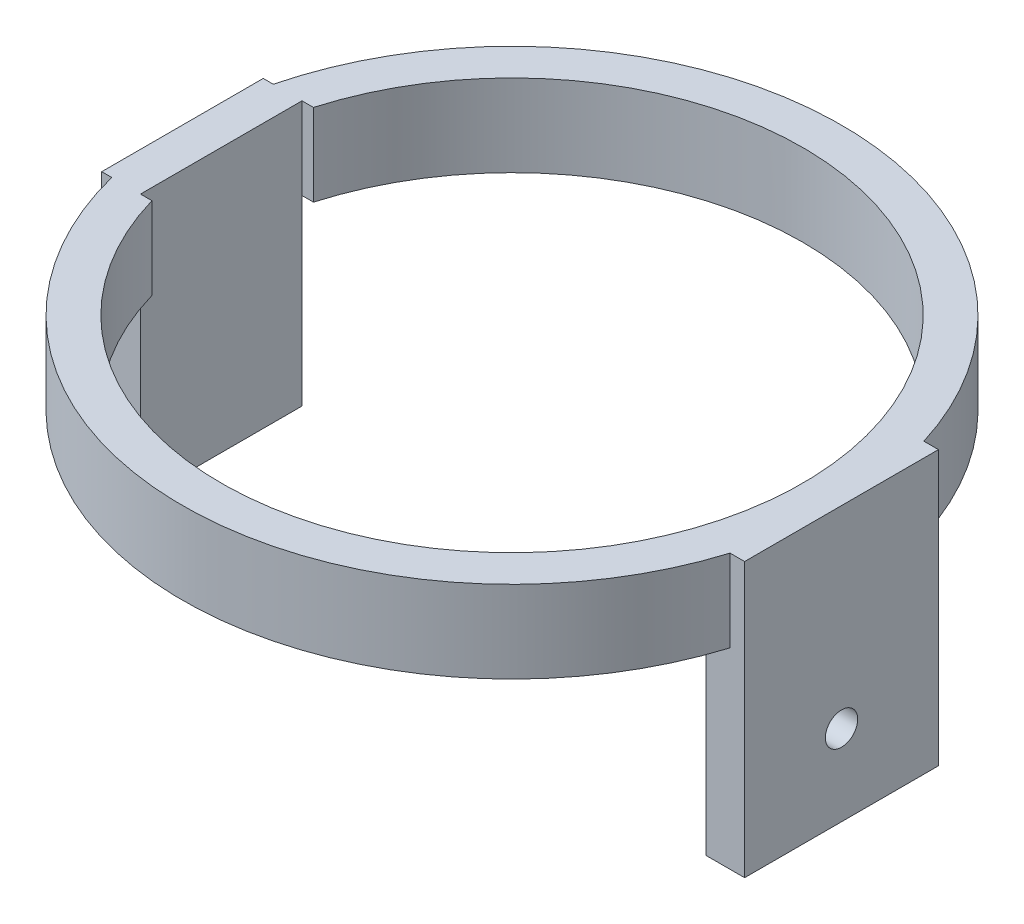
ISO-10303-21;
HEADER;
FILE_DESCRIPTION(('STEP AP214'),'2;1');
FILE_NAME('part.step','',(''),(''),'','','');
FILE_SCHEMA(('AUTOMOTIVE_DESIGN { 1 0 10303 214 1 1 1 1 }'));
ENDSEC;
DATA;
#1=APPLICATION_CONTEXT('core data for automotive mechanical design processes');
#2=APPLICATION_PROTOCOL_DEFINITION('international standard','automotive_design',2000,#1);
#3=PRODUCT_CONTEXT('',#1,'mechanical');
#4=PRODUCT('Part','Part','',(#3));
#5=PRODUCT_RELATED_PRODUCT_CATEGORY('part','',(#4));
#6=PRODUCT_DEFINITION_FORMATION('','',#4);
#7=PRODUCT_DEFINITION_CONTEXT('part definition',#1,'design');
#8=PRODUCT_DEFINITION('design','',#6,#7);
#9=PRODUCT_DEFINITION_SHAPE('','',#8);
#10=(LENGTH_UNIT() NAMED_UNIT(*) SI_UNIT(.MILLI.,.METRE.));
#11=(NAMED_UNIT(*) PLANE_ANGLE_UNIT() SI_UNIT($,.RADIAN.));
#12=(NAMED_UNIT(*) SI_UNIT($,.STERADIAN.) SOLID_ANGLE_UNIT());
#13=UNCERTAINTY_MEASURE_WITH_UNIT(LENGTH_MEASURE(1.E-05),#10,'distance_accuracy_value','');
#14=(GEOMETRIC_REPRESENTATION_CONTEXT(3) GLOBAL_UNCERTAINTY_ASSIGNED_CONTEXT((#13)) GLOBAL_UNIT_ASSIGNED_CONTEXT((#10,
#11,#12)) REPRESENTATION_CONTEXT('',''));
#15=CARTESIAN_POINT('',(0.,0.,0.));
#16=DIRECTION('',(0.,0.,1.));
#17=DIRECTION('',(1.,0.,0.));
#18=AXIS2_PLACEMENT_3D('',#15,#16,#17);
#19=CARTESIAN_POINT('',(0.,-25.4,0.));
#20=DIRECTION('',(0.,1.,0.));
#21=DIRECTION('',(0.,0.,1.));
#22=AXIS2_PLACEMENT_3D('',#19,#20,#21);
#23=CYLINDRICAL_SURFACE('',#22,102.);
#24=CARTESIAN_POINT('',(0.,-25.4,0.));
#25=DIRECTION('',(0.,1.,0.));
#26=DIRECTION('',(0.,0.,1.));
#27=AXIS2_PLACEMENT_3D('',#24,#25,#26);
#28=CIRCLE('',#27,102.);
#29=CARTESIAN_POINT('',(-98.8888264668966,-25.4,25.));
#30=VERTEX_POINT('',#29);
#31=CARTESIAN_POINT('',(97.4884608556315,-25.4,30.));
#32=VERTEX_POINT('',#31);
#33=EDGE_CURVE('E11',#30,#32,#28,.T.);
#34=ORIENTED_EDGE('',*,*,#33,.T.);
#35=DIRECTION('',(0.,1.,0.));
#36=VECTOR('',#35,1.);
#37=CARTESIAN_POINT('',(97.4884608556315,-25.4,30.));
#38=LINE('',#37,#36);
#39=CARTESIAN_POINT('',(97.4884608556315,0.,30.));
#40=VERTEX_POINT('',#39);
#41=EDGE_CURVE('E208',#32,#40,#38,.T.);
#42=ORIENTED_EDGE('',*,*,#41,.T.);
#43=CARTESIAN_POINT('',(0.,0.,0.));
#44=DIRECTION('',(0.,1.,0.));
#45=DIRECTION('',(0.,0.,1.));
#46=AXIS2_PLACEMENT_3D('',#43,#44,#45);
#47=CIRCLE('',#46,102.);
#48=CARTESIAN_POINT('',(-98.8888264668966,0.,25.));
#49=VERTEX_POINT('',#48);
#50=EDGE_CURVE('E43',#49,#40,#47,.T.);
#51=ORIENTED_EDGE('',*,*,#50,.F.);
#52=DIRECTION('',(0.,1.,0.));
#53=VECTOR('',#52,1.);
#54=CARTESIAN_POINT('',(-98.8888264668966,-25.4,25.));
#55=LINE('',#54,#53);
#56=EDGE_CURVE('E290',#30,#49,#55,.T.);
#57=ORIENTED_EDGE('',*,*,#56,.F.);
#58=EDGE_LOOP('',(#34,#42,#51,#57));
#59=FACE_BOUND('',#58,.T.);
#60=ADVANCED_FACE('F39',(#59),#23,.T.);
#61=CARTESIAN_POINT('',(0.,-25.4,0.));
#62=DIRECTION('',(0.,1.,0.));
#63=DIRECTION('',(0.,0.,1.));
#64=AXIS2_PLACEMENT_3D('',#61,#62,#63);
#65=PLANE('',#64);
#66=DIRECTION('',(0.,0.,-1.));
#67=VECTOR('',#66,1.);
#68=CARTESIAN_POINT('',(90.,-25.4,0.));
#69=LINE('',#68,#67);
#70=CARTESIAN_POINT('',(90.,-25.4,30.));
#71=VERTEX_POINT('',#70);
#72=CARTESIAN_POINT('',(90.,-25.4,0.));
#73=VERTEX_POINT('',#72);
#74=EDGE_CURVE('E203',#71,#73,#69,.T.);
#75=ORIENTED_EDGE('',*,*,#74,.F.);
#76=DIRECTION('',(-1.,0.,0.));
#77=VECTOR('',#76,1.);
#78=CARTESIAN_POINT('',(0.,-25.4,30.));
#79=LINE('',#78,#77);
#80=EDGE_CURVE('E204',#32,#71,#79,.T.);
#81=ORIENTED_EDGE('',*,*,#80,.F.);
#82=ORIENTED_EDGE('',*,*,#33,.F.);
#83=DIRECTION('',(1.,0.,0.));
#84=VECTOR('',#83,1.);
#85=CARTESIAN_POINT('',(0.,-25.4,25.));
#86=LINE('',#85,#84);
#87=CARTESIAN_POINT('',(-90.,-25.4,25.));
#88=VERTEX_POINT('',#87);
#89=EDGE_CURVE('E272',#30,#88,#86,.T.);
#90=ORIENTED_EDGE('',*,*,#89,.T.);
#91=DIRECTION('',(-1.,0.,0.));
#92=VECTOR('',#91,1.);
#93=CARTESIAN_POINT('',(-90.,-25.4,25.));
#94=LINE('',#93,#92);
#95=CARTESIAN_POINT('',(-86.4580823289529,-25.4,25.));
#96=VERTEX_POINT('',#95);
#97=EDGE_CURVE('E216',#96,#88,#94,.T.);
#98=ORIENTED_EDGE('',*,*,#97,.F.);
#99=CARTESIAN_POINT('',(0.,-25.4,0.));
#100=DIRECTION('',(0.,1.,0.));
#101=DIRECTION('',(0.,0.,1.));
#102=AXIS2_PLACEMENT_3D('',#99,#100,#101);
#103=CIRCLE('',#102,90.);
#104=EDGE_CURVE('E303',#96,#73,#103,.T.);
#105=ORIENTED_EDGE('',*,*,#104,.T.);
#106=EDGE_LOOP('',(#75,#81,#82,#90,#98,#105));
#107=FACE_BOUND('',#106,.T.);
#108=ADVANCED_FACE('F340',(#107),#65,.F.);
#109=DIRECTION('',(0.,1.,0.));
#110=VECTOR('',#109,1.);
#111=CARTESIAN_POINT('',(97.4884608556315,-25.4,-30.));
#112=LINE('',#111,#110);
#113=CARTESIAN_POINT('',(97.4884608556315,-25.4,-30.));
#114=VERTEX_POINT('',#113);
#115=CARTESIAN_POINT('',(97.4884608556315,0.,-30.));
#116=VERTEX_POINT('',#115);
#117=EDGE_CURVE('E64',#114,#116,#112,.T.);
#118=ORIENTED_EDGE('',*,*,#117,.F.);
#119=CARTESIAN_POINT('',(-98.8888264668966,-25.4,-25.));
#120=VERTEX_POINT('',#119);
#121=EDGE_CURVE('E49',#114,#120,#28,.T.);
#122=ORIENTED_EDGE('',*,*,#121,.T.);
#123=DIRECTION('',(0.,1.,0.));
#124=VECTOR('',#123,1.);
#125=CARTESIAN_POINT('',(-98.8888264668966,-25.4,-25.));
#126=LINE('',#125,#124);
#127=CARTESIAN_POINT('',(-98.8888264668966,0.,-25.));
#128=VERTEX_POINT('',#127);
#129=EDGE_CURVE('E298',#120,#128,#126,.T.);
#130=ORIENTED_EDGE('',*,*,#129,.T.);
#131=EDGE_CURVE('E307',#116,#128,#47,.T.);
#132=ORIENTED_EDGE('',*,*,#131,.F.);
#133=EDGE_LOOP('',(#118,#122,#130,#132));
#134=FACE_BOUND('',#133,.T.);
#135=ADVANCED_FACE('F41',(#134),#23,.T.);
#136=ORIENTED_EDGE('',*,*,#121,.F.);
#137=DIRECTION('',(-1.,0.,0.));
#138=VECTOR('',#137,1.);
#139=CARTESIAN_POINT('',(0.,-25.4,-30.));
#140=LINE('',#139,#138);
#141=CARTESIAN_POINT('',(90.,-25.4,-30.));
#142=VERTEX_POINT('',#141);
#143=EDGE_CURVE('E56',#114,#142,#140,.T.);
#144=ORIENTED_EDGE('',*,*,#143,.T.);
#145=EDGE_CURVE('E200',#73,#142,#69,.T.);
#146=ORIENTED_EDGE('',*,*,#145,.F.);
#147=CARTESIAN_POINT('',(-86.4580823289529,-25.4,-25.));
#148=VERTEX_POINT('',#147);
#149=EDGE_CURVE('E308',#73,#148,#103,.T.);
#150=ORIENTED_EDGE('',*,*,#149,.T.);
#151=DIRECTION('',(1.,0.,0.));
#152=VECTOR('',#151,1.);
#153=CARTESIAN_POINT('',(-86.4580823289529,-25.4,-25.));
#154=LINE('',#153,#152);
#155=CARTESIAN_POINT('',(-90.,-25.4,-25.));
#156=VERTEX_POINT('',#155);
#157=EDGE_CURVE('E215',#156,#148,#154,.T.);
#158=ORIENTED_EDGE('',*,*,#157,.F.);
#159=DIRECTION('',(1.,0.,0.));
#160=VECTOR('',#159,1.);
#161=CARTESIAN_POINT('',(0.,-25.4,-25.));
#162=LINE('',#161,#160);
#163=EDGE_CURVE('E294',#120,#156,#162,.T.);
#164=ORIENTED_EDGE('',*,*,#163,.F.);
#165=EDGE_LOOP('',(#136,#144,#146,#150,#158,#164));
#166=FACE_BOUND('',#165,.T.);
#167=ADVANCED_FACE('F317',(#166),#65,.F.);
#168=CARTESIAN_POINT('',(0.,0.,0.));
#169=DIRECTION('',(0.,1.,0.));
#170=DIRECTION('',(0.,0.,1.));
#171=AXIS2_PLACEMENT_3D('',#168,#169,#170);
#172=PLANE('',#171);
#173=DIRECTION('',(1.,0.,0.));
#174=VECTOR('',#173,1.);
#175=CARTESIAN_POINT('',(-86.4580823289529,0.,-25.));
#176=LINE('',#175,#174);
#177=CARTESIAN_POINT('',(-90.,0.,-25.));
#178=VERTEX_POINT('',#177);
#179=CARTESIAN_POINT('',(-86.4580823289529,0.,-25.));
#180=VERTEX_POINT('',#179);
#181=EDGE_CURVE('E220',#178,#180,#176,.T.);
#182=ORIENTED_EDGE('',*,*,#181,.T.);
#183=CARTESIAN_POINT('',(0.,0.,0.));
#184=DIRECTION('',(0.,1.,0.));
#185=DIRECTION('',(0.,0.,1.));
#186=AXIS2_PLACEMENT_3D('',#183,#184,#185);
#187=CIRCLE('',#186,90.);
#188=CARTESIAN_POINT('',(-86.4580823289529,0.,25.));
#189=VERTEX_POINT('',#188);
#190=EDGE_CURVE('E302',#189,#180,#187,.T.);
#191=ORIENTED_EDGE('',*,*,#190,.F.);
#192=DIRECTION('',(-1.,0.,0.));
#193=VECTOR('',#192,1.);
#194=CARTESIAN_POINT('',(-90.,0.,25.));
#195=LINE('',#194,#193);
#196=CARTESIAN_POINT('',(-90.,0.,25.));
#197=VERTEX_POINT('',#196);
#198=EDGE_CURVE('E233',#189,#197,#195,.T.);
#199=ORIENTED_EDGE('',*,*,#198,.T.);
#200=DIRECTION('',(0.,0.,-1.));
#201=VECTOR('',#200,1.);
#202=CARTESIAN_POINT('',(-90.,0.,25.));
#203=LINE('',#202,#201);
#204=EDGE_CURVE('E228',#197,#178,#203,.T.);
#205=ORIENTED_EDGE('',*,*,#204,.T.);
#206=EDGE_LOOP('',(#182,#191,#199,#205));
#207=FACE_BOUND('',#206,.T.);
#208=ORIENTED_EDGE('',*,*,#50,.T.);
#209=DIRECTION('',(-1.,0.,0.));
#210=VECTOR('',#209,1.);
#211=CARTESIAN_POINT('',(205.85585043824,0.,30.));
#212=LINE('',#211,#210);
#213=CARTESIAN_POINT('',(102.,0.,30.));
#214=VERTEX_POINT('',#213);
#215=EDGE_CURVE('E192',#214,#40,#212,.T.);
#216=ORIENTED_EDGE('',*,*,#215,.F.);
#217=DIRECTION('',(0.,0.,1.));
#218=VECTOR('',#217,1.);
#219=CARTESIAN_POINT('',(102.,0.,-30.));
#220=LINE('',#219,#218);
#221=CARTESIAN_POINT('',(102.,0.,-30.));
#222=VERTEX_POINT('',#221);
#223=EDGE_CURVE('E186',#222,#214,#220,.T.);
#224=ORIENTED_EDGE('',*,*,#223,.F.);
#225=DIRECTION('',(-1.,0.,0.));
#226=VECTOR('',#225,1.);
#227=CARTESIAN_POINT('',(205.85585043824,0.,-30.));
#228=LINE('',#227,#226);
#229=EDGE_CURVE('E177',#222,#116,#228,.T.);
#230=ORIENTED_EDGE('',*,*,#229,.T.);
#231=ORIENTED_EDGE('',*,*,#131,.T.);
#232=DIRECTION('',(1.,0.,0.));
#233=VECTOR('',#232,1.);
#234=CARTESIAN_POINT('',(-197.899625072051,0.,-25.));
#235=LINE('',#234,#233);
#236=CARTESIAN_POINT('',(-102.,0.,-25.));
#237=VERTEX_POINT('',#236);
#238=EDGE_CURVE('E247',#237,#128,#235,.T.);
#239=ORIENTED_EDGE('',*,*,#238,.F.);
#240=DIRECTION('',(0.,0.,-1.));
#241=VECTOR('',#240,1.);
#242=CARTESIAN_POINT('',(-102.,0.,25.));
#243=LINE('',#242,#241);
#244=CARTESIAN_POINT('',(-102.,0.,25.));
#245=VERTEX_POINT('',#244);
#246=EDGE_CURVE('E256',#245,#237,#243,.T.);
#247=ORIENTED_EDGE('',*,*,#246,.F.);
#248=DIRECTION('',(1.,0.,0.));
#249=VECTOR('',#248,1.);
#250=CARTESIAN_POINT('',(-197.899625072051,0.,25.));
#251=LINE('',#250,#249);
#252=EDGE_CURVE('E260',#245,#49,#251,.T.);
#253=ORIENTED_EDGE('',*,*,#252,.T.);
#254=EDGE_LOOP('',(#208,#216,#224,#230,#231,#239,#247,#253));
#255=FACE_BOUND('',#254,.T.);
#256=ADVANCED_FACE('F327',(#207,#255),#172,.T.);
#257=CARTESIAN_POINT('',(0.,-25.4,0.));
#258=DIRECTION('',(0.,1.,0.));
#259=DIRECTION('',(0.,0.,1.));
#260=AXIS2_PLACEMENT_3D('',#257,#258,#259);
#261=CYLINDRICAL_SURFACE('',#260,90.);
#262=ORIENTED_EDGE('',*,*,#190,.T.);
#263=DIRECTION('',(0.,-1.,0.));
#264=VECTOR('',#263,1.);
#265=CARTESIAN_POINT('',(-86.4580823289529,50.1252948199657,-25.));
#266=LINE('',#265,#264);
#267=EDGE_CURVE('E227',#180,#148,#266,.T.);
#268=ORIENTED_EDGE('',*,*,#267,.T.);
#269=ORIENTED_EDGE('',*,*,#149,.F.);
#270=ORIENTED_EDGE('',*,*,#104,.F.);
#271=DIRECTION('',(0.,-1.,0.));
#272=VECTOR('',#271,1.);
#273=CARTESIAN_POINT('',(-86.4580823289529,50.1252948199657,25.));
#274=LINE('',#273,#272);
#275=EDGE_CURVE('E237',#189,#96,#274,.T.);
#276=ORIENTED_EDGE('',*,*,#275,.F.);
#277=EDGE_LOOP('',(#262,#268,#269,#270,#276));
#278=FACE_BOUND('',#277,.T.);
#279=ADVANCED_FACE('F324',(#278),#261,.F.);
#280=CARTESIAN_POINT('',(-90.,0.,0.));
#281=DIRECTION('',(-1.,0.,0.));
#282=DIRECTION('',(0.,0.,1.));
#283=AXIS2_PLACEMENT_3D('',#280,#281,#282);
#284=PLANE('',#283);
#285=DIRECTION('',(0.,-1.,0.));
#286=VECTOR('',#285,1.);
#287=CARTESIAN_POINT('',(-90.,-25.4,-25.));
#288=LINE('',#287,#286);
#289=CARTESIAN_POINT('',(-90.,-81.8336,-25.));
#290=VERTEX_POINT('',#289);
#291=EDGE_CURVE('E248',#156,#290,#288,.T.);
#292=ORIENTED_EDGE('',*,*,#291,.F.);
#293=DIRECTION('',(0.,-1.,0.));
#294=VECTOR('',#293,1.);
#295=CARTESIAN_POINT('',(-90.,50.1252948199657,-25.));
#296=LINE('',#295,#294);
#297=EDGE_CURVE('E231',#178,#156,#296,.T.);
#298=ORIENTED_EDGE('',*,*,#297,.F.);
#299=ORIENTED_EDGE('',*,*,#204,.F.);
#300=DIRECTION('',(0.,-1.,0.));
#301=VECTOR('',#300,1.);
#302=CARTESIAN_POINT('',(-90.,50.1252948199657,25.));
#303=LINE('',#302,#301);
#304=EDGE_CURVE('E232',#197,#88,#303,.T.);
#305=ORIENTED_EDGE('',*,*,#304,.T.);
#306=DIRECTION('',(0.,-1.,0.));
#307=VECTOR('',#306,1.);
#308=CARTESIAN_POINT('',(-90.,-25.4,25.));
#309=LINE('',#308,#307);
#310=CARTESIAN_POINT('',(-90.,-81.8336,25.));
#311=VERTEX_POINT('',#310);
#312=EDGE_CURVE('E257',#88,#311,#309,.T.);
#313=ORIENTED_EDGE('',*,*,#312,.T.);
#314=DIRECTION('',(0.,0.,-1.));
#315=VECTOR('',#314,1.);
#316=CARTESIAN_POINT('',(-90.,-81.8336,25.));
#317=LINE('',#316,#315);
#318=EDGE_CURVE('E252',#311,#290,#317,.T.);
#319=ORIENTED_EDGE('',*,*,#318,.T.);
#320=EDGE_LOOP('',(#292,#298,#299,#305,#313,#319));
#321=FACE_BOUND('',#320,.T.);
#322=ADVANCED_FACE('F326',(#321),#284,.F.);
#323=CARTESIAN_POINT('',(-197.899625072051,-25.4,-25.));
#324=DIRECTION('',(0.,0.,1.));
#325=DIRECTION('',(0.,-1.,0.));
#326=AXIS2_PLACEMENT_3D('',#323,#324,#325);
#327=PLANE('',#326);
#328=ORIENTED_EDGE('',*,*,#129,.F.);
#329=ORIENTED_EDGE('',*,*,#163,.T.);
#330=ORIENTED_EDGE('',*,*,#291,.T.);
#331=DIRECTION('',(1.,0.,0.));
#332=VECTOR('',#331,1.);
#333=CARTESIAN_POINT('',(-197.899625072051,-81.8336,-25.));
#334=LINE('',#333,#332);
#335=CARTESIAN_POINT('',(-102.,-81.8336,-25.));
#336=VERTEX_POINT('',#335);
#337=EDGE_CURVE('E265',#336,#290,#334,.T.);
#338=ORIENTED_EDGE('',*,*,#337,.F.);
#339=DIRECTION('',(0.,-1.,0.));
#340=VECTOR('',#339,1.);
#341=CARTESIAN_POINT('',(-102.,-25.4,-25.));
#342=LINE('',#341,#340);
#343=EDGE_CURVE('E268',#237,#336,#342,.T.);
#344=ORIENTED_EDGE('',*,*,#343,.F.);
#345=ORIENTED_EDGE('',*,*,#238,.T.);
#346=EDGE_LOOP('',(#328,#329,#330,#338,#344,#345));
#347=FACE_BOUND('',#346,.T.);
#348=ADVANCED_FACE('F333',(#347),#327,.F.);
#349=CARTESIAN_POINT('',(-197.899625072051,-81.8336,25.));
#350=DIRECTION('',(0.,-1.,0.));
#351=DIRECTION('',(0.,0.,-1.));
#352=AXIS2_PLACEMENT_3D('',#349,#350,#351);
#353=PLANE('',#352);
#354=DIRECTION('',(1.,0.,0.));
#355=VECTOR('',#354,1.);
#356=CARTESIAN_POINT('',(-197.899625072051,-81.8336,25.));
#357=LINE('',#356,#355);
#358=CARTESIAN_POINT('',(-102.,-81.8336,25.));
#359=VERTEX_POINT('',#358);
#360=EDGE_CURVE('E264',#359,#311,#357,.T.);
#361=ORIENTED_EDGE('',*,*,#360,.F.);
#362=DIRECTION('',(0.,0.,-1.));
#363=VECTOR('',#362,1.);
#364=CARTESIAN_POINT('',(-102.,-81.8336,25.));
#365=LINE('',#364,#363);
#366=EDGE_CURVE('E251',#359,#336,#365,.T.);
#367=ORIENTED_EDGE('',*,*,#366,.T.);
#368=ORIENTED_EDGE('',*,*,#337,.T.);
#369=ORIENTED_EDGE('',*,*,#318,.F.);
#370=EDGE_LOOP('',(#361,#367,#368,#369));
#371=FACE_BOUND('',#370,.T.);
#372=ADVANCED_FACE('F435',(#371),#353,.T.);
#373=CARTESIAN_POINT('',(-197.899625072051,-25.4,25.));
#374=DIRECTION('',(0.,0.,1.));
#375=DIRECTION('',(0.,-1.,0.));
#376=AXIS2_PLACEMENT_3D('',#373,#374,#375);
#377=PLANE('',#376);
#378=ORIENTED_EDGE('',*,*,#89,.F.);
#379=ORIENTED_EDGE('',*,*,#56,.T.);
#380=ORIENTED_EDGE('',*,*,#252,.F.);
#381=DIRECTION('',(0.,-1.,0.));
#382=VECTOR('',#381,1.);
#383=CARTESIAN_POINT('',(-102.,-25.4,25.));
#384=LINE('',#383,#382);
#385=EDGE_CURVE('E261',#245,#359,#384,.T.);
#386=ORIENTED_EDGE('',*,*,#385,.T.);
#387=ORIENTED_EDGE('',*,*,#360,.T.);
#388=ORIENTED_EDGE('',*,*,#312,.F.);
#389=EDGE_LOOP('',(#378,#379,#380,#386,#387,#388));
#390=FACE_BOUND('',#389,.T.);
#391=ADVANCED_FACE('F432',(#390),#377,.T.);
#392=CARTESIAN_POINT('',(-102.,0.,0.));
#393=DIRECTION('',(-1.,0.,0.));
#394=DIRECTION('',(0.,0.,1.));
#395=AXIS2_PLACEMENT_3D('',#392,#393,#394);
#396=PLANE('',#395);
#397=ORIENTED_EDGE('',*,*,#246,.T.);
#398=ORIENTED_EDGE('',*,*,#343,.T.);
#399=ORIENTED_EDGE('',*,*,#366,.F.);
#400=ORIENTED_EDGE('',*,*,#385,.F.);
#401=EDGE_LOOP('',(#397,#398,#399,#400));
#402=FACE_BOUND('',#401,.T.);
#403=ADVANCED_FACE('F430',(#402),#396,.T.);
#404=CARTESIAN_POINT('',(-86.4580823289529,50.1252948199657,-25.));
#405=DIRECTION('',(0.,0.,-1.));
#406=DIRECTION('',(-1.,0.,0.));
#407=AXIS2_PLACEMENT_3D('',#404,#405,#406);
#408=PLANE('',#407);
#409=ORIENTED_EDGE('',*,*,#297,.T.);
#410=ORIENTED_EDGE('',*,*,#157,.T.);
#411=ORIENTED_EDGE('',*,*,#267,.F.);
#412=ORIENTED_EDGE('',*,*,#181,.F.);
#413=EDGE_LOOP('',(#409,#410,#411,#412));
#414=FACE_BOUND('',#413,.T.);
#415=ADVANCED_FACE('F321',(#414),#408,.F.);
#416=CARTESIAN_POINT('',(-90.,50.1252948199657,25.));
#417=DIRECTION('',(0.,0.,1.));
#418=DIRECTION('',(1.,0.,0.));
#419=AXIS2_PLACEMENT_3D('',#416,#417,#418);
#420=PLANE('',#419);
#421=ORIENTED_EDGE('',*,*,#275,.T.);
#422=ORIENTED_EDGE('',*,*,#97,.T.);
#423=ORIENTED_EDGE('',*,*,#304,.F.);
#424=ORIENTED_EDGE('',*,*,#198,.F.);
#425=EDGE_LOOP('',(#421,#422,#423,#424));
#426=FACE_BOUND('',#425,.T.);
#427=ADVANCED_FACE('F404',(#426),#420,.F.);
#428=CARTESIAN_POINT('',(90.,0.,0.));
#429=DIRECTION('',(1.,0.,0.));
#430=DIRECTION('',(0.,0.,-1.));
#431=AXIS2_PLACEMENT_3D('',#428,#429,#430);
#432=PLANE('',#431);
#433=CARTESIAN_POINT('',(90.,-59.7705,0.));
#434=DIRECTION('',(-1.,0.,0.));
#435=DIRECTION('',(0.,0.,1.));
#436=AXIS2_PLACEMENT_3D('',#433,#434,#435);
#437=CIRCLE('',#436,5.);
#438=CARTESIAN_POINT('',(90.,-59.7705,4.99999999999999));
#439=VERTEX_POINT('',#438);
#440=EDGE_CURVE('E473',#439,#439,#437,.T.);
#441=ORIENTED_EDGE('',*,*,#440,.F.);
#442=EDGE_LOOP('',(#441));
#443=FACE_BOUND('',#442,.T.);
#444=DIRECTION('',(0.,-1.,0.));
#445=VECTOR('',#444,1.);
#446=CARTESIAN_POINT('',(90.,0.,30.));
#447=LINE('',#446,#445);
#448=CARTESIAN_POINT('',(90.,-84.7705,30.));
#449=VERTEX_POINT('',#448);
#450=EDGE_CURVE('E185',#71,#449,#447,.T.);
#451=ORIENTED_EDGE('',*,*,#450,.F.);
#452=ORIENTED_EDGE('',*,*,#74,.T.);
#453=ORIENTED_EDGE('',*,*,#145,.T.);
#454=DIRECTION('',(0.,-1.,0.));
#455=VECTOR('',#454,1.);
#456=CARTESIAN_POINT('',(90.,0.,-30.));
#457=LINE('',#456,#455);
#458=CARTESIAN_POINT('',(90.,-84.7705,-30.));
#459=VERTEX_POINT('',#458);
#460=EDGE_CURVE('E181',#142,#459,#457,.T.);
#461=ORIENTED_EDGE('',*,*,#460,.T.);
#462=DIRECTION('',(0.,0.,1.));
#463=VECTOR('',#462,1.);
#464=CARTESIAN_POINT('',(90.,-84.7705,-30.));
#465=LINE('',#464,#463);
#466=EDGE_CURVE('E169',#459,#449,#465,.T.);
#467=ORIENTED_EDGE('',*,*,#466,.T.);
#468=EDGE_LOOP('',(#451,#452,#453,#461,#467));
#469=FACE_BOUND('',#468,.T.);
#470=ADVANCED_FACE('F400',(#443,#469),#432,.F.);
#471=CARTESIAN_POINT('',(102.,0.,0.));
#472=DIRECTION('',(1.,0.,0.));
#473=DIRECTION('',(0.,0.,-1.));
#474=AXIS2_PLACEMENT_3D('',#471,#472,#473);
#475=PLANE('',#474);
#476=CARTESIAN_POINT('',(102.,-59.7705,0.));
#477=DIRECTION('',(1.,0.,0.));
#478=DIRECTION('',(0.,0.,-1.));
#479=AXIS2_PLACEMENT_3D('',#476,#477,#478);
#480=CIRCLE('',#479,5.);
#481=CARTESIAN_POINT('',(102.,-59.7705,-5.));
#482=VERTEX_POINT('',#481);
#483=EDGE_CURVE('E189',#482,#482,#480,.T.);
#484=ORIENTED_EDGE('',*,*,#483,.F.);
#485=EDGE_LOOP('',(#484));
#486=FACE_BOUND('',#485,.T.);
#487=DIRECTION('',(0.,-1.,0.));
#488=VECTOR('',#487,1.);
#489=CARTESIAN_POINT('',(102.,0.,-30.));
#490=LINE('',#489,#488);
#491=CARTESIAN_POINT('',(102.,-84.7705,-30.));
#492=VERTEX_POINT('',#491);
#493=EDGE_CURVE('E154',#222,#492,#490,.T.);
#494=ORIENTED_EDGE('',*,*,#493,.F.);
#495=ORIENTED_EDGE('',*,*,#223,.T.);
#496=DIRECTION('',(0.,-1.,0.));
#497=VECTOR('',#496,1.);
#498=CARTESIAN_POINT('',(102.,0.,30.));
#499=LINE('',#498,#497);
#500=CARTESIAN_POINT('',(102.,-84.7705,30.));
#501=VERTEX_POINT('',#500);
#502=EDGE_CURVE('E157',#214,#501,#499,.T.);
#503=ORIENTED_EDGE('',*,*,#502,.T.);
#504=DIRECTION('',(0.,0.,1.));
#505=VECTOR('',#504,1.);
#506=CARTESIAN_POINT('',(102.,-84.7705,-30.));
#507=LINE('',#506,#505);
#508=EDGE_CURVE('E150',#492,#501,#507,.T.);
#509=ORIENTED_EDGE('',*,*,#508,.F.);
#510=EDGE_LOOP('',(#494,#495,#503,#509));
#511=FACE_BOUND('',#510,.T.);
#512=ADVANCED_FACE('F152',(#486,#511),#475,.T.);
#513=CARTESIAN_POINT('',(205.85585043824,0.,-30.));
#514=DIRECTION('',(0.,0.,-1.));
#515=DIRECTION('',(0.,1.,0.));
#516=AXIS2_PLACEMENT_3D('',#513,#514,#515);
#517=PLANE('',#516);
#518=ORIENTED_EDGE('',*,*,#143,.F.);
#519=ORIENTED_EDGE('',*,*,#117,.T.);
#520=ORIENTED_EDGE('',*,*,#229,.F.);
#521=ORIENTED_EDGE('',*,*,#493,.T.);
#522=DIRECTION('',(-1.,0.,0.));
#523=VECTOR('',#522,1.);
#524=CARTESIAN_POINT('',(205.85585043824,-84.7705,-30.));
#525=LINE('',#524,#523);
#526=EDGE_CURVE('E163',#492,#459,#525,.T.);
#527=ORIENTED_EDGE('',*,*,#526,.T.);
#528=ORIENTED_EDGE('',*,*,#460,.F.);
#529=EDGE_LOOP('',(#518,#519,#520,#521,#527,#528));
#530=FACE_BOUND('',#529,.T.);
#531=ADVANCED_FACE('F175',(#530),#517,.T.);
#532=CARTESIAN_POINT('',(205.85585043824,-84.7705,-30.));
#533=DIRECTION('',(0.,-1.,0.));
#534=DIRECTION('',(0.,0.,-1.));
#535=AXIS2_PLACEMENT_3D('',#532,#533,#534);
#536=PLANE('',#535);
#537=ORIENTED_EDGE('',*,*,#526,.F.);
#538=ORIENTED_EDGE('',*,*,#508,.T.);
#539=DIRECTION('',(-1.,0.,0.));
#540=VECTOR('',#539,1.);
#541=CARTESIAN_POINT('',(205.85585043824,-84.7705,30.));
#542=LINE('',#541,#540);
#543=EDGE_CURVE('E162',#501,#449,#542,.T.);
#544=ORIENTED_EDGE('',*,*,#543,.T.);
#545=ORIENTED_EDGE('',*,*,#466,.F.);
#546=EDGE_LOOP('',(#537,#538,#544,#545));
#547=FACE_BOUND('',#546,.T.);
#548=ADVANCED_FACE('F167',(#547),#536,.T.);
#549=CARTESIAN_POINT('',(205.85585043824,0.,30.));
#550=DIRECTION('',(0.,0.,-1.));
#551=DIRECTION('',(0.,1.,0.));
#552=AXIS2_PLACEMENT_3D('',#549,#550,#551);
#553=PLANE('',#552);
#554=ORIENTED_EDGE('',*,*,#41,.F.);
#555=ORIENTED_EDGE('',*,*,#80,.T.);
#556=ORIENTED_EDGE('',*,*,#450,.T.);
#557=ORIENTED_EDGE('',*,*,#543,.F.);
#558=ORIENTED_EDGE('',*,*,#502,.F.);
#559=ORIENTED_EDGE('',*,*,#215,.T.);
#560=EDGE_LOOP('',(#554,#555,#556,#557,#558,#559));
#561=FACE_BOUND('',#560,.T.);
#562=ADVANCED_FACE('F383',(#561),#553,.F.);
#563=CARTESIAN_POINT('',(90.,-59.7705,0.));
#564=DIRECTION('',(-1.,0.,0.));
#565=DIRECTION('',(0.,0.,1.));
#566=AXIS2_PLACEMENT_3D('',#563,#564,#565);
#567=CYLINDRICAL_SURFACE('',#566,5.);
#568=ORIENTED_EDGE('',*,*,#440,.T.);
#569=EDGE_LOOP('',(#568));
#570=FACE_BOUND('',#569,.T.);
#571=ORIENTED_EDGE('',*,*,#483,.T.);
#572=EDGE_LOOP('',(#571));
#573=FACE_BOUND('',#572,.T.);
#574=ADVANCED_FACE('F392',(#570,#573),#567,.F.);
#575=CLOSED_SHELL('',(#60,#108,#135,#167,#256,#279,#322,#348,#372,#391,#403,#415,#427,#470,#512,
#531,#548,#562,#574));
#576=MANIFOLD_SOLID_BREP('B2',#575);
#577=ADVANCED_BREP_SHAPE_REPRESENTATION('',(#18,#576),#14);
#578=SHAPE_DEFINITION_REPRESENTATION(#9,#577);
ENDSEC;
END-ISO-10303-21;
